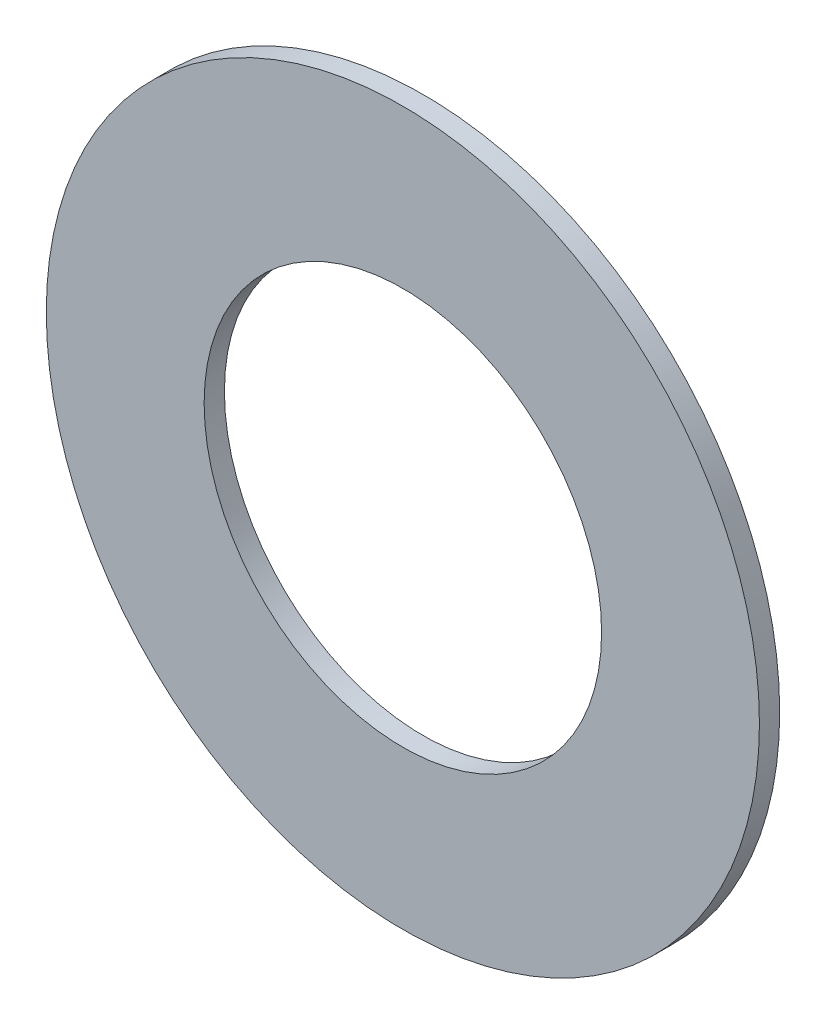
ISO-10303-21;
HEADER;
FILE_DESCRIPTION(('STEP AP214'),'2;1');
FILE_NAME('part.step','',(''),(''),'','','');
FILE_SCHEMA(('AUTOMOTIVE_DESIGN { 1 0 10303 214 1 1 1 1 }'));
ENDSEC;
DATA;
#1=APPLICATION_CONTEXT('core data for automotive mechanical design processes');
#2=APPLICATION_PROTOCOL_DEFINITION('international standard','automotive_design',2000,#1);
#3=PRODUCT_CONTEXT('',#1,'mechanical');
#4=PRODUCT('Part','Part','',(#3));
#5=PRODUCT_RELATED_PRODUCT_CATEGORY('part','',(#4));
#6=PRODUCT_DEFINITION_FORMATION('','',#4);
#7=PRODUCT_DEFINITION_CONTEXT('part definition',#1,'design');
#8=PRODUCT_DEFINITION('design','',#6,#7);
#9=PRODUCT_DEFINITION_SHAPE('','',#8);
#10=(LENGTH_UNIT() NAMED_UNIT(*) SI_UNIT(.MILLI.,.METRE.));
#11=(NAMED_UNIT(*) PLANE_ANGLE_UNIT() SI_UNIT($,.RADIAN.));
#12=(NAMED_UNIT(*) SI_UNIT($,.STERADIAN.) SOLID_ANGLE_UNIT());
#13=UNCERTAINTY_MEASURE_WITH_UNIT(LENGTH_MEASURE(1.E-05),#10,'distance_accuracy_value','');
#14=(GEOMETRIC_REPRESENTATION_CONTEXT(3) GLOBAL_UNCERTAINTY_ASSIGNED_CONTEXT((#13)) GLOBAL_UNIT_ASSIGNED_CONTEXT((#10,
#11,#12)) REPRESENTATION_CONTEXT('',''));
#15=CARTESIAN_POINT('',(0.,0.,0.));
#16=DIRECTION('',(0.,0.,1.));
#17=DIRECTION('',(1.,0.,0.));
#18=AXIS2_PLACEMENT_3D('',#15,#16,#17);
#19=CARTESIAN_POINT('',(0.,0.,-0.406399999999997));
#20=DIRECTION('',(0.,0.,1.));
#21=DIRECTION('',(1.,0.,0.));
#22=AXIS2_PLACEMENT_3D('',#19,#20,#21);
#23=CYLINDRICAL_SURFACE('',#22,14.2875);
#24=CARTESIAN_POINT('',(0.,0.,-0.406399999999997));
#25=DIRECTION('',(0.,0.,1.));
#26=DIRECTION('',(1.,0.,0.));
#27=AXIS2_PLACEMENT_3D('',#24,#25,#26);
#28=CIRCLE('',#27,14.2875);
#29=CARTESIAN_POINT('',(14.2875,0.,-0.406399999999997));
#30=VERTEX_POINT('',#29);
#31=EDGE_CURVE('E10',#30,#30,#28,.T.);
#32=ORIENTED_EDGE('',*,*,#31,.T.);
#33=EDGE_LOOP('',(#32));
#34=FACE_BOUND('',#33,.T.);
#35=CARTESIAN_POINT('',(0.,0.,0.406400000000003));
#36=DIRECTION('',(0.,0.,1.));
#37=DIRECTION('',(1.,0.,0.));
#38=AXIS2_PLACEMENT_3D('',#35,#36,#37);
#39=CIRCLE('',#38,14.2875);
#40=CARTESIAN_POINT('',(14.2875,0.,0.406400000000003));
#41=VERTEX_POINT('',#40);
#42=EDGE_CURVE('E42',#41,#41,#39,.T.);
#43=ORIENTED_EDGE('',*,*,#42,.F.);
#44=EDGE_LOOP('',(#43));
#45=FACE_BOUND('',#44,.T.);
#46=ADVANCED_FACE('F32',(#34,#45),#23,.T.);
#47=CARTESIAN_POINT('',(0.,0.,-0.406399999999997));
#48=DIRECTION('',(0.,0.,1.));
#49=DIRECTION('',(1.,0.,0.));
#50=AXIS2_PLACEMENT_3D('',#47,#48,#49);
#51=PLANE('',#50);
#52=CARTESIAN_POINT('',(0.,0.,-0.406399999999997));
#53=DIRECTION('',(0.,0.,1.));
#54=DIRECTION('',(1.,0.,0.));
#55=AXIS2_PLACEMENT_3D('',#52,#53,#54);
#56=CIRCLE('',#55,7.9629);
#57=CARTESIAN_POINT('',(7.9629,0.,-0.406399999999997));
#58=VERTEX_POINT('',#57);
#59=EDGE_CURVE('E38',#58,#58,#56,.T.);
#60=ORIENTED_EDGE('',*,*,#59,.T.);
#61=EDGE_LOOP('',(#60));
#62=FACE_BOUND('',#61,.T.);
#63=ORIENTED_EDGE('',*,*,#31,.F.);
#64=EDGE_LOOP('',(#63));
#65=FACE_BOUND('',#64,.T.);
#66=ADVANCED_FACE('F61',(#62,#65),#51,.F.);
#67=CARTESIAN_POINT('',(0.,0.,-0.406399999999997));
#68=DIRECTION('',(0.,0.,1.));
#69=DIRECTION('',(1.,0.,0.));
#70=AXIS2_PLACEMENT_3D('',#67,#68,#69);
#71=CYLINDRICAL_SURFACE('',#70,7.9629);
#72=ORIENTED_EDGE('',*,*,#59,.F.);
#73=EDGE_LOOP('',(#72));
#74=FACE_BOUND('',#73,.T.);
#75=CARTESIAN_POINT('',(0.,0.,0.406400000000003));
#76=DIRECTION('',(0.,0.,1.));
#77=DIRECTION('',(1.,0.,0.));
#78=AXIS2_PLACEMENT_3D('',#75,#76,#77);
#79=CIRCLE('',#78,7.9629);
#80=CARTESIAN_POINT('',(7.9629,0.,0.406400000000003));
#81=VERTEX_POINT('',#80);
#82=EDGE_CURVE('E46',#81,#81,#79,.T.);
#83=ORIENTED_EDGE('',*,*,#82,.T.);
#84=EDGE_LOOP('',(#83));
#85=FACE_BOUND('',#84,.T.);
#86=ADVANCED_FACE('F52',(#74,#85),#71,.F.);
#87=CARTESIAN_POINT('',(0.,0.,0.406400000000003));
#88=DIRECTION('',(0.,0.,1.));
#89=DIRECTION('',(1.,0.,0.));
#90=AXIS2_PLACEMENT_3D('',#87,#88,#89);
#91=PLANE('',#90);
#92=ORIENTED_EDGE('',*,*,#42,.T.);
#93=EDGE_LOOP('',(#92));
#94=FACE_BOUND('',#93,.T.);
#95=ORIENTED_EDGE('',*,*,#82,.F.);
#96=EDGE_LOOP('',(#95));
#97=FACE_BOUND('',#96,.T.);
#98=ADVANCED_FACE('F54',(#94,#97),#91,.T.);
#99=CLOSED_SHELL('',(#46,#66,#86,#98));
#100=MANIFOLD_SOLID_BREP('B2',#99);
#101=ADVANCED_BREP_SHAPE_REPRESENTATION('',(#18,#100),#14);
#102=SHAPE_DEFINITION_REPRESENTATION(#9,#101);
ENDSEC;
END-ISO-10303-21;
